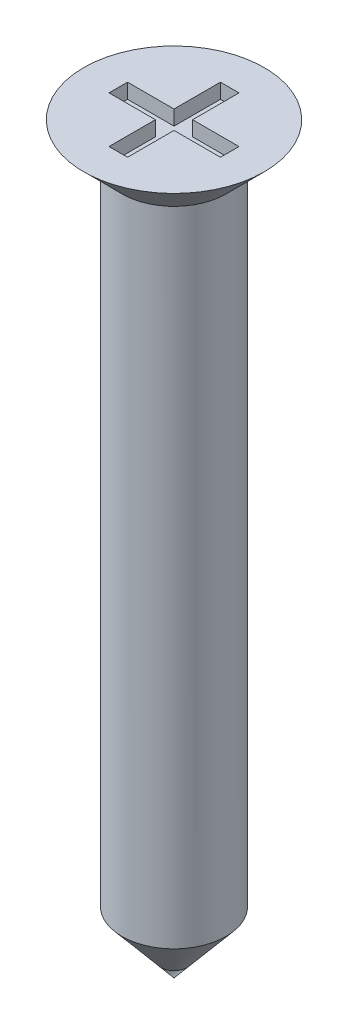
ISO-10303-21;
HEADER;
FILE_DESCRIPTION(('STEP AP214'),'2;1');
FILE_NAME('part.step','',(''),(''),'','','');
FILE_SCHEMA(('AUTOMOTIVE_DESIGN { 1 0 10303 214 1 1 1 1 }'));
ENDSEC;
DATA;
#1=APPLICATION_CONTEXT('core data for automotive mechanical design processes');
#2=APPLICATION_PROTOCOL_DEFINITION('international standard','automotive_design',2000,#1);
#3=PRODUCT_CONTEXT('',#1,'mechanical');
#4=PRODUCT('Part','Part','',(#3));
#5=PRODUCT_RELATED_PRODUCT_CATEGORY('part','',(#4));
#6=PRODUCT_DEFINITION_FORMATION('','',#4);
#7=PRODUCT_DEFINITION_CONTEXT('part definition',#1,'design');
#8=PRODUCT_DEFINITION('design','',#6,#7);
#9=PRODUCT_DEFINITION_SHAPE('','',#8);
#10=(LENGTH_UNIT() NAMED_UNIT(*) SI_UNIT(.MILLI.,.METRE.));
#11=(NAMED_UNIT(*) PLANE_ANGLE_UNIT() SI_UNIT($,.RADIAN.));
#12=(NAMED_UNIT(*) SI_UNIT($,.STERADIAN.) SOLID_ANGLE_UNIT());
#13=UNCERTAINTY_MEASURE_WITH_UNIT(LENGTH_MEASURE(1.E-05),#10,'distance_accuracy_value','');
#14=(GEOMETRIC_REPRESENTATION_CONTEXT(3) GLOBAL_UNCERTAINTY_ASSIGNED_CONTEXT((#13)) GLOBAL_UNIT_ASSIGNED_CONTEXT((#10,
#11,#12)) REPRESENTATION_CONTEXT('',''));
#15=CARTESIAN_POINT('',(0.,0.,0.));
#16=DIRECTION('',(0.,0.,1.));
#17=DIRECTION('',(1.,0.,0.));
#18=AXIS2_PLACEMENT_3D('',#15,#16,#17);
#19=CARTESIAN_POINT('',(0.,-9.16577248518406,0.));
#20=DIRECTION('',(0.,1.,0.));
#21=DIRECTION('',(-1.,0.,0.));
#22=AXIS2_PLACEMENT_3D('',#19,#20,#21);
#23=CONICAL_SURFACE('',#22,0.7,0.698131700797737);
#24=CARTESIAN_POINT('',(0.,-10.,0.));
#25=VERTEX_POINT('',#24);
#26=VERTEX_LOOP('',#25);
#27=FACE_BOUND('',#26,.T.);
#28=CARTESIAN_POINT('',(0.,-9.16577248518406,0.));
#29=DIRECTION('',(0.,-1.,0.));
#30=DIRECTION('',(1.,0.,0.));
#31=AXIS2_PLACEMENT_3D('',#28,#29,#30);
#32=CIRCLE('',#31,0.7);
#33=CARTESIAN_POINT('',(0.700000000000001,-9.16577248518406,0.));
#34=VERTEX_POINT('',#33);
#35=EDGE_CURVE('E11',#34,#34,#32,.T.);
#36=ORIENTED_EDGE('',*,*,#35,.T.);
#37=EDGE_LOOP('',(#36));
#38=FACE_BOUND('',#37,.T.);
#39=ADVANCED_FACE('F39',(#27,#38),#23,.T.);
#40=CARTESIAN_POINT('',(0.,-10.,0.));
#41=DIRECTION('',(0.,-1.,0.));
#42=DIRECTION('',(1.,0.,0.));
#43=AXIS2_PLACEMENT_3D('',#40,#41,#42);
#44=CYLINDRICAL_SURFACE('',#43,0.7);
#45=ORIENTED_EDGE('',*,*,#35,.F.);
#46=EDGE_LOOP('',(#45));
#47=FACE_BOUND('',#46,.T.);
#48=CARTESIAN_POINT('',(0.,-0.514999999999995,0.));
#49=DIRECTION('',(0.,-1.,0.));
#50=DIRECTION('',(1.,0.,0.));
#51=AXIS2_PLACEMENT_3D('',#48,#49,#50);
#52=CIRCLE('',#51,0.7);
#53=CARTESIAN_POINT('',(0.7,-0.514999999999995,0.));
#54=VERTEX_POINT('',#53);
#55=EDGE_CURVE('E47',#54,#54,#52,.T.);
#56=ORIENTED_EDGE('',*,*,#55,.T.);
#57=EDGE_LOOP('',(#56));
#58=FACE_BOUND('',#57,.T.);
#59=ADVANCED_FACE('F273',(#47,#58),#44,.T.);
#60=CARTESIAN_POINT('',(0.,0.,0.));
#61=DIRECTION('',(0.,1.,0.));
#62=DIRECTION('',(-1.,0.,0.));
#63=AXIS2_PLACEMENT_3D('',#60,#61,#62);
#64=CONICAL_SURFACE('',#63,1.215,0.785398163397454);
#65=ORIENTED_EDGE('',*,*,#55,.F.);
#66=EDGE_LOOP('',(#65));
#67=FACE_BOUND('',#66,.T.);
#68=CARTESIAN_POINT('',(0.,0.,0.));
#69=DIRECTION('',(0.,-1.,0.));
#70=DIRECTION('',(1.,0.,0.));
#71=AXIS2_PLACEMENT_3D('',#68,#69,#70);
#72=CIRCLE('',#71,1.215);
#73=CARTESIAN_POINT('',(1.215,0.,0.));
#74=VERTEX_POINT('',#73);
#75=EDGE_CURVE('E237',#74,#74,#72,.T.);
#76=ORIENTED_EDGE('',*,*,#75,.T.);
#77=EDGE_LOOP('',(#76));
#78=FACE_BOUND('',#77,.T.);
#79=ADVANCED_FACE('F275',(#67,#78),#64,.T.);
#80=CARTESIAN_POINT('',(0.,0.,0.));
#81=DIRECTION('',(0.,-1.,0.));
#82=DIRECTION('',(1.,0.,0.));
#83=AXIS2_PLACEMENT_3D('',#80,#81,#82);
#84=PLANE('',#83);
#85=DIRECTION('',(0.,0.,-1.));
#86=VECTOR('',#85,1.);
#87=CARTESIAN_POINT('',(0.125,0.,-0.125));
#88=LINE('',#87,#86);
#89=CARTESIAN_POINT('',(0.125,0.,-0.125));
#90=VERTEX_POINT('',#89);
#91=CARTESIAN_POINT('',(0.125,0.,-0.75));
#92=VERTEX_POINT('',#91);
#93=EDGE_CURVE('E196',#90,#92,#88,.T.);
#94=ORIENTED_EDGE('',*,*,#93,.F.);
#95=DIRECTION('',(-1.,0.,0.));
#96=VECTOR('',#95,1.);
#97=CARTESIAN_POINT('',(0.125,0.,-0.125));
#98=LINE('',#97,#96);
#99=CARTESIAN_POINT('',(0.75,0.,-0.125));
#100=VERTEX_POINT('',#99);
#101=EDGE_CURVE('E54',#100,#90,#98,.T.);
#102=ORIENTED_EDGE('',*,*,#101,.F.);
#103=DIRECTION('',(0.,0.,-1.));
#104=VECTOR('',#103,1.);
#105=CARTESIAN_POINT('',(0.75,0.,0.125));
#106=LINE('',#105,#104);
#107=CARTESIAN_POINT('',(0.75,0.,0.125));
#108=VERTEX_POINT('',#107);
#109=EDGE_CURVE('E152',#108,#100,#106,.T.);
#110=ORIENTED_EDGE('',*,*,#109,.F.);
#111=DIRECTION('',(1.,0.,0.));
#112=VECTOR('',#111,1.);
#113=CARTESIAN_POINT('',(0.125,0.,0.125));
#114=LINE('',#113,#112);
#115=CARTESIAN_POINT('',(0.125,0.,0.125));
#116=VERTEX_POINT('',#115);
#117=EDGE_CURVE('E156',#116,#108,#114,.T.);
#118=ORIENTED_EDGE('',*,*,#117,.F.);
#119=DIRECTION('',(0.,0.,-1.));
#120=VECTOR('',#119,1.);
#121=CARTESIAN_POINT('',(0.125,0.,0.75));
#122=LINE('',#121,#120);
#123=CARTESIAN_POINT('',(0.125,0.,0.75));
#124=VERTEX_POINT('',#123);
#125=EDGE_CURVE('E227',#124,#116,#122,.T.);
#126=ORIENTED_EDGE('',*,*,#125,.F.);
#127=DIRECTION('',(1.,0.,0.));
#128=VECTOR('',#127,1.);
#129=CARTESIAN_POINT('',(-0.125,0.,0.75));
#130=LINE('',#129,#128);
#131=CARTESIAN_POINT('',(-0.125,0.,0.75));
#132=VERTEX_POINT('',#131);
#133=EDGE_CURVE('E223',#132,#124,#130,.T.);
#134=ORIENTED_EDGE('',*,*,#133,.F.);
#135=DIRECTION('',(0.,0.,1.));
#136=VECTOR('',#135,1.);
#137=CARTESIAN_POINT('',(-0.125,0.,0.75));
#138=LINE('',#137,#136);
#139=CARTESIAN_POINT('',(-0.125,0.,0.125));
#140=VERTEX_POINT('',#139);
#141=EDGE_CURVE('E219',#140,#132,#138,.T.);
#142=ORIENTED_EDGE('',*,*,#141,.F.);
#143=DIRECTION('',(1.,0.,0.));
#144=VECTOR('',#143,1.);
#145=CARTESIAN_POINT('',(-0.75,0.,0.125));
#146=LINE('',#145,#144);
#147=CARTESIAN_POINT('',(-0.75,0.,0.125));
#148=VERTEX_POINT('',#147);
#149=EDGE_CURVE('E215',#148,#140,#146,.T.);
#150=ORIENTED_EDGE('',*,*,#149,.F.);
#151=DIRECTION('',(0.,0.,1.));
#152=VECTOR('',#151,1.);
#153=CARTESIAN_POINT('',(-0.75,0.,0.125));
#154=LINE('',#153,#152);
#155=CARTESIAN_POINT('',(-0.75,0.,-0.125));
#156=VERTEX_POINT('',#155);
#157=EDGE_CURVE('E211',#156,#148,#154,.T.);
#158=ORIENTED_EDGE('',*,*,#157,.F.);
#159=DIRECTION('',(-1.,0.,0.));
#160=VECTOR('',#159,1.);
#161=CARTESIAN_POINT('',(-0.75,0.,-0.125));
#162=LINE('',#161,#160);
#163=CARTESIAN_POINT('',(-0.125,0.,-0.125));
#164=VERTEX_POINT('',#163);
#165=EDGE_CURVE('E207',#164,#156,#162,.T.);
#166=ORIENTED_EDGE('',*,*,#165,.F.);
#167=DIRECTION('',(0.,0.,1.));
#168=VECTOR('',#167,1.);
#169=CARTESIAN_POINT('',(-0.125,0.,-0.125));
#170=LINE('',#169,#168);
#171=CARTESIAN_POINT('',(-0.125,0.,-0.75));
#172=VERTEX_POINT('',#171);
#173=EDGE_CURVE('E203',#172,#164,#170,.T.);
#174=ORIENTED_EDGE('',*,*,#173,.F.);
#175=DIRECTION('',(-1.,0.,0.));
#176=VECTOR('',#175,1.);
#177=CARTESIAN_POINT('',(-0.125,0.,-0.75));
#178=LINE('',#177,#176);
#179=EDGE_CURVE('E199',#92,#172,#178,.T.);
#180=ORIENTED_EDGE('',*,*,#179,.F.);
#181=EDGE_LOOP('',(#94,#102,#110,#118,#126,#134,#142,#150,#158,#166,#174,#180));
#182=FACE_BOUND('',#181,.T.);
#183=ORIENTED_EDGE('',*,*,#75,.F.);
#184=EDGE_LOOP('',(#183));
#185=FACE_BOUND('',#184,.T.);
#186=ADVANCED_FACE('F278',(#182,#185),#84,.F.);
#187=CARTESIAN_POINT('',(0.125,-0.2,-0.125));
#188=DIRECTION('',(0.,0.,-1.));
#189=DIRECTION('',(-1.,0.,0.));
#190=AXIS2_PLACEMENT_3D('',#187,#188,#189);
#191=PLANE('',#190);
#192=ORIENTED_EDGE('',*,*,#101,.T.);
#193=DIRECTION('',(0.,1.,0.));
#194=VECTOR('',#193,1.);
#195=CARTESIAN_POINT('',(0.125,-0.2,-0.125));
#196=LINE('',#195,#194);
#197=CARTESIAN_POINT('',(0.125,-0.2,-0.125));
#198=VERTEX_POINT('',#197);
#199=EDGE_CURVE('E126',#198,#90,#196,.T.);
#200=ORIENTED_EDGE('',*,*,#199,.F.);
#201=DIRECTION('',(-1.,0.,0.));
#202=VECTOR('',#201,1.);
#203=CARTESIAN_POINT('',(0.125,-0.2,-0.125));
#204=LINE('',#203,#202);
#205=CARTESIAN_POINT('',(0.75,-0.2,-0.125));
#206=VERTEX_POINT('',#205);
#207=EDGE_CURVE('E130',#206,#198,#204,.T.);
#208=ORIENTED_EDGE('',*,*,#207,.F.);
#209=DIRECTION('',(0.,1.,0.));
#210=VECTOR('',#209,1.);
#211=CARTESIAN_POINT('',(0.75,-0.2,-0.125));
#212=LINE('',#211,#210);
#213=EDGE_CURVE('E234',#206,#100,#212,.T.);
#214=ORIENTED_EDGE('',*,*,#213,.T.);
#215=EDGE_LOOP('',(#192,#200,#208,#214));
#216=FACE_BOUND('',#215,.T.);
#217=ADVANCED_FACE('F128',(#216),#191,.F.);
#218=CARTESIAN_POINT('',(0.75,-0.2,0.125));
#219=DIRECTION('',(1.,0.,0.));
#220=DIRECTION('',(0.,0.,-1.));
#221=AXIS2_PLACEMENT_3D('',#218,#219,#220);
#222=PLANE('',#221);
#223=ORIENTED_EDGE('',*,*,#109,.T.);
#224=ORIENTED_EDGE('',*,*,#213,.F.);
#225=DIRECTION('',(0.,0.,-1.));
#226=VECTOR('',#225,1.);
#227=CARTESIAN_POINT('',(0.75,-0.2,0.125));
#228=LINE('',#227,#226);
#229=CARTESIAN_POINT('',(0.75,-0.2,0.125));
#230=VERTEX_POINT('',#229);
#231=EDGE_CURVE('E137',#230,#206,#228,.T.);
#232=ORIENTED_EDGE('',*,*,#231,.F.);
#233=DIRECTION('',(0.,1.,0.));
#234=VECTOR('',#233,1.);
#235=CARTESIAN_POINT('',(0.75,-0.2,0.125));
#236=LINE('',#235,#234);
#237=EDGE_CURVE('E238',#230,#108,#236,.T.);
#238=ORIENTED_EDGE('',*,*,#237,.T.);
#239=EDGE_LOOP('',(#223,#224,#232,#238));
#240=FACE_BOUND('',#239,.T.);
#241=ADVANCED_FACE('F288',(#240),#222,.F.);
#242=CARTESIAN_POINT('',(0.125,-0.2,0.125));
#243=DIRECTION('',(0.,0.,1.));
#244=DIRECTION('',(1.,0.,0.));
#245=AXIS2_PLACEMENT_3D('',#242,#243,#244);
#246=PLANE('',#245);
#247=ORIENTED_EDGE('',*,*,#117,.T.);
#248=ORIENTED_EDGE('',*,*,#237,.F.);
#249=DIRECTION('',(1.,0.,0.));
#250=VECTOR('',#249,1.);
#251=CARTESIAN_POINT('',(0.125,-0.2,0.125));
#252=LINE('',#251,#250);
#253=CARTESIAN_POINT('',(0.125,-0.2,0.125));
#254=VERTEX_POINT('',#253);
#255=EDGE_CURVE('E189',#254,#230,#252,.T.);
#256=ORIENTED_EDGE('',*,*,#255,.F.);
#257=DIRECTION('',(0.,1.,0.));
#258=VECTOR('',#257,1.);
#259=CARTESIAN_POINT('',(0.125,-0.2,0.125));
#260=LINE('',#259,#258);
#261=EDGE_CURVE('E241',#254,#116,#260,.T.);
#262=ORIENTED_EDGE('',*,*,#261,.T.);
#263=EDGE_LOOP('',(#247,#248,#256,#262));
#264=FACE_BOUND('',#263,.T.);
#265=ADVANCED_FACE('F322',(#264),#246,.F.);
#266=CARTESIAN_POINT('',(0.125,-0.2,0.75));
#267=DIRECTION('',(1.,0.,0.));
#268=DIRECTION('',(0.,0.,-1.));
#269=AXIS2_PLACEMENT_3D('',#266,#267,#268);
#270=PLANE('',#269);
#271=ORIENTED_EDGE('',*,*,#125,.T.);
#272=ORIENTED_EDGE('',*,*,#261,.F.);
#273=DIRECTION('',(0.,0.,-1.));
#274=VECTOR('',#273,1.);
#275=CARTESIAN_POINT('',(0.125,-0.2,0.75));
#276=LINE('',#275,#274);
#277=CARTESIAN_POINT('',(0.125,-0.2,0.75));
#278=VERTEX_POINT('',#277);
#279=EDGE_CURVE('E185',#278,#254,#276,.T.);
#280=ORIENTED_EDGE('',*,*,#279,.F.);
#281=DIRECTION('',(0.,1.,0.));
#282=VECTOR('',#281,1.);
#283=CARTESIAN_POINT('',(0.125,-0.2,0.75));
#284=LINE('',#283,#282);
#285=EDGE_CURVE('E244',#278,#124,#284,.T.);
#286=ORIENTED_EDGE('',*,*,#285,.T.);
#287=EDGE_LOOP('',(#271,#272,#280,#286));
#288=FACE_BOUND('',#287,.T.);
#289=ADVANCED_FACE('F332',(#288),#270,.F.);
#290=CARTESIAN_POINT('',(-0.125,-0.2,0.75));
#291=DIRECTION('',(0.,0.,1.));
#292=DIRECTION('',(1.,0.,0.));
#293=AXIS2_PLACEMENT_3D('',#290,#291,#292);
#294=PLANE('',#293);
#295=ORIENTED_EDGE('',*,*,#133,.T.);
#296=ORIENTED_EDGE('',*,*,#285,.F.);
#297=DIRECTION('',(1.,0.,0.));
#298=VECTOR('',#297,1.);
#299=CARTESIAN_POINT('',(-0.125,-0.2,0.75));
#300=LINE('',#299,#298);
#301=CARTESIAN_POINT('',(-0.125,-0.2,0.75));
#302=VERTEX_POINT('',#301);
#303=EDGE_CURVE('E181',#302,#278,#300,.T.);
#304=ORIENTED_EDGE('',*,*,#303,.F.);
#305=DIRECTION('',(0.,1.,0.));
#306=VECTOR('',#305,1.);
#307=CARTESIAN_POINT('',(-0.125,-0.2,0.75));
#308=LINE('',#307,#306);
#309=EDGE_CURVE('E247',#302,#132,#308,.T.);
#310=ORIENTED_EDGE('',*,*,#309,.T.);
#311=EDGE_LOOP('',(#295,#296,#304,#310));
#312=FACE_BOUND('',#311,.T.);
#313=ADVANCED_FACE('F342',(#312),#294,.F.);
#314=CARTESIAN_POINT('',(-0.125,-0.2,0.75));
#315=DIRECTION('',(-1.,0.,0.));
#316=DIRECTION('',(0.,0.,1.));
#317=AXIS2_PLACEMENT_3D('',#314,#315,#316);
#318=PLANE('',#317);
#319=ORIENTED_EDGE('',*,*,#141,.T.);
#320=ORIENTED_EDGE('',*,*,#309,.F.);
#321=DIRECTION('',(0.,0.,1.));
#322=VECTOR('',#321,1.);
#323=CARTESIAN_POINT('',(-0.125,-0.2,0.75));
#324=LINE('',#323,#322);
#325=CARTESIAN_POINT('',(-0.125,-0.2,0.125));
#326=VERTEX_POINT('',#325);
#327=EDGE_CURVE('E177',#326,#302,#324,.T.);
#328=ORIENTED_EDGE('',*,*,#327,.F.);
#329=DIRECTION('',(0.,1.,0.));
#330=VECTOR('',#329,1.);
#331=CARTESIAN_POINT('',(-0.125,-0.2,0.125));
#332=LINE('',#331,#330);
#333=EDGE_CURVE('E250',#326,#140,#332,.T.);
#334=ORIENTED_EDGE('',*,*,#333,.T.);
#335=EDGE_LOOP('',(#319,#320,#328,#334));
#336=FACE_BOUND('',#335,.T.);
#337=ADVANCED_FACE('F352',(#336),#318,.F.);
#338=CARTESIAN_POINT('',(-0.75,-0.2,0.125));
#339=DIRECTION('',(0.,0.,1.));
#340=DIRECTION('',(1.,0.,0.));
#341=AXIS2_PLACEMENT_3D('',#338,#339,#340);
#342=PLANE('',#341);
#343=ORIENTED_EDGE('',*,*,#149,.T.);
#344=ORIENTED_EDGE('',*,*,#333,.F.);
#345=DIRECTION('',(1.,0.,0.));
#346=VECTOR('',#345,1.);
#347=CARTESIAN_POINT('',(-0.75,-0.2,0.125));
#348=LINE('',#347,#346);
#349=CARTESIAN_POINT('',(-0.75,-0.2,0.125));
#350=VERTEX_POINT('',#349);
#351=EDGE_CURVE('E173',#350,#326,#348,.T.);
#352=ORIENTED_EDGE('',*,*,#351,.F.);
#353=DIRECTION('',(0.,1.,0.));
#354=VECTOR('',#353,1.);
#355=CARTESIAN_POINT('',(-0.75,-0.2,0.125));
#356=LINE('',#355,#354);
#357=EDGE_CURVE('E253',#350,#148,#356,.T.);
#358=ORIENTED_EDGE('',*,*,#357,.T.);
#359=EDGE_LOOP('',(#343,#344,#352,#358));
#360=FACE_BOUND('',#359,.T.);
#361=ADVANCED_FACE('F362',(#360),#342,.F.);
#362=CARTESIAN_POINT('',(-0.75,-0.2,0.125));
#363=DIRECTION('',(-1.,0.,0.));
#364=DIRECTION('',(0.,0.,1.));
#365=AXIS2_PLACEMENT_3D('',#362,#363,#364);
#366=PLANE('',#365);
#367=ORIENTED_EDGE('',*,*,#157,.T.);
#368=ORIENTED_EDGE('',*,*,#357,.F.);
#369=DIRECTION('',(0.,0.,1.));
#370=VECTOR('',#369,1.);
#371=CARTESIAN_POINT('',(-0.75,-0.2,0.125));
#372=LINE('',#371,#370);
#373=CARTESIAN_POINT('',(-0.75,-0.2,-0.125));
#374=VERTEX_POINT('',#373);
#375=EDGE_CURVE('E169',#374,#350,#372,.T.);
#376=ORIENTED_EDGE('',*,*,#375,.F.);
#377=DIRECTION('',(0.,1.,0.));
#378=VECTOR('',#377,1.);
#379=CARTESIAN_POINT('',(-0.75,-0.2,-0.125));
#380=LINE('',#379,#378);
#381=EDGE_CURVE('E256',#374,#156,#380,.T.);
#382=ORIENTED_EDGE('',*,*,#381,.T.);
#383=EDGE_LOOP('',(#367,#368,#376,#382));
#384=FACE_BOUND('',#383,.T.);
#385=ADVANCED_FACE('F372',(#384),#366,.F.);
#386=CARTESIAN_POINT('',(-0.75,-0.2,-0.125));
#387=DIRECTION('',(0.,0.,-1.));
#388=DIRECTION('',(-1.,0.,0.));
#389=AXIS2_PLACEMENT_3D('',#386,#387,#388);
#390=PLANE('',#389);
#391=ORIENTED_EDGE('',*,*,#165,.T.);
#392=ORIENTED_EDGE('',*,*,#381,.F.);
#393=DIRECTION('',(-1.,0.,0.));
#394=VECTOR('',#393,1.);
#395=CARTESIAN_POINT('',(-0.75,-0.2,-0.125));
#396=LINE('',#395,#394);
#397=CARTESIAN_POINT('',(-0.125,-0.2,-0.125));
#398=VERTEX_POINT('',#397);
#399=EDGE_CURVE('E165',#398,#374,#396,.T.);
#400=ORIENTED_EDGE('',*,*,#399,.F.);
#401=DIRECTION('',(0.,1.,0.));
#402=VECTOR('',#401,1.);
#403=CARTESIAN_POINT('',(-0.125,-0.2,-0.125));
#404=LINE('',#403,#402);
#405=EDGE_CURVE('E259',#398,#164,#404,.T.);
#406=ORIENTED_EDGE('',*,*,#405,.T.);
#407=EDGE_LOOP('',(#391,#392,#400,#406));
#408=FACE_BOUND('',#407,.T.);
#409=ADVANCED_FACE('F382',(#408),#390,.F.);
#410=CARTESIAN_POINT('',(-0.125,-0.2,-0.125));
#411=DIRECTION('',(-1.,0.,0.));
#412=DIRECTION('',(0.,0.,1.));
#413=AXIS2_PLACEMENT_3D('',#410,#411,#412);
#414=PLANE('',#413);
#415=ORIENTED_EDGE('',*,*,#173,.T.);
#416=ORIENTED_EDGE('',*,*,#405,.F.);
#417=DIRECTION('',(0.,0.,1.));
#418=VECTOR('',#417,1.);
#419=CARTESIAN_POINT('',(-0.125,-0.2,-0.125));
#420=LINE('',#419,#418);
#421=CARTESIAN_POINT('',(-0.125,-0.2,-0.75));
#422=VERTEX_POINT('',#421);
#423=EDGE_CURVE('E161',#422,#398,#420,.T.);
#424=ORIENTED_EDGE('',*,*,#423,.F.);
#425=DIRECTION('',(0.,1.,0.));
#426=VECTOR('',#425,1.);
#427=CARTESIAN_POINT('',(-0.125,-0.2,-0.75));
#428=LINE('',#427,#426);
#429=EDGE_CURVE('E262',#422,#172,#428,.T.);
#430=ORIENTED_EDGE('',*,*,#429,.T.);
#431=EDGE_LOOP('',(#415,#416,#424,#430));
#432=FACE_BOUND('',#431,.T.);
#433=ADVANCED_FACE('F392',(#432),#414,.F.);
#434=CARTESIAN_POINT('',(-0.125,-0.2,-0.75));
#435=DIRECTION('',(0.,0.,-1.));
#436=DIRECTION('',(-1.,0.,0.));
#437=AXIS2_PLACEMENT_3D('',#434,#435,#436);
#438=PLANE('',#437);
#439=ORIENTED_EDGE('',*,*,#179,.T.);
#440=ORIENTED_EDGE('',*,*,#429,.F.);
#441=DIRECTION('',(-1.,0.,0.));
#442=VECTOR('',#441,1.);
#443=CARTESIAN_POINT('',(-0.125,-0.2,-0.75));
#444=LINE('',#443,#442);
#445=CARTESIAN_POINT('',(0.125,-0.2,-0.75));
#446=VERTEX_POINT('',#445);
#447=EDGE_CURVE('E146',#446,#422,#444,.T.);
#448=ORIENTED_EDGE('',*,*,#447,.F.);
#449=DIRECTION('',(0.,1.,0.));
#450=VECTOR('',#449,1.);
#451=CARTESIAN_POINT('',(0.125,-0.2,-0.75));
#452=LINE('',#451,#450);
#453=EDGE_CURVE('E136',#446,#92,#452,.T.);
#454=ORIENTED_EDGE('',*,*,#453,.T.);
#455=EDGE_LOOP('',(#439,#440,#448,#454));
#456=FACE_BOUND('',#455,.T.);
#457=ADVANCED_FACE('F402',(#456),#438,.F.);
#458=CARTESIAN_POINT('',(0.125,-0.2,-0.125));
#459=DIRECTION('',(1.,0.,0.));
#460=DIRECTION('',(0.,0.,-1.));
#461=AXIS2_PLACEMENT_3D('',#458,#459,#460);
#462=PLANE('',#461);
#463=ORIENTED_EDGE('',*,*,#93,.T.);
#464=ORIENTED_EDGE('',*,*,#453,.F.);
#465=DIRECTION('',(0.,0.,-1.));
#466=VECTOR('',#465,1.);
#467=CARTESIAN_POINT('',(0.125,-0.2,-0.125));
#468=LINE('',#467,#466);
#469=EDGE_CURVE('E140',#198,#446,#468,.T.);
#470=ORIENTED_EDGE('',*,*,#469,.F.);
#471=ORIENTED_EDGE('',*,*,#199,.T.);
#472=EDGE_LOOP('',(#463,#464,#470,#471));
#473=FACE_BOUND('',#472,.T.);
#474=ADVANCED_FACE('F141',(#473),#462,.F.);
#475=CARTESIAN_POINT('',(0.,-0.2,0.));
#476=DIRECTION('',(0.,1.,0.));
#477=DIRECTION('',(0.,0.,1.));
#478=AXIS2_PLACEMENT_3D('',#475,#476,#477);
#479=PLANE('',#478);
#480=ORIENTED_EDGE('',*,*,#207,.T.);
#481=ORIENTED_EDGE('',*,*,#469,.T.);
#482=ORIENTED_EDGE('',*,*,#447,.T.);
#483=ORIENTED_EDGE('',*,*,#423,.T.);
#484=ORIENTED_EDGE('',*,*,#399,.T.);
#485=ORIENTED_EDGE('',*,*,#375,.T.);
#486=ORIENTED_EDGE('',*,*,#351,.T.);
#487=ORIENTED_EDGE('',*,*,#327,.T.);
#488=ORIENTED_EDGE('',*,*,#303,.T.);
#489=ORIENTED_EDGE('',*,*,#279,.T.);
#490=ORIENTED_EDGE('',*,*,#255,.T.);
#491=ORIENTED_EDGE('',*,*,#231,.T.);
#492=EDGE_LOOP('',(#480,#481,#482,#483,#484,#485,#486,#487,#488,#489,#490,#491));
#493=FACE_BOUND('',#492,.T.);
#494=ADVANCED_FACE('F148',(#493),#479,.T.);
#495=CLOSED_SHELL('',(#39,#59,#79,#186,#217,#241,#265,#289,#313,#337,#361,#385,#409,#433,#457,
#474,#494));
#496=MANIFOLD_SOLID_BREP('B2',#495);
#497=ADVANCED_BREP_SHAPE_REPRESENTATION('',(#18,#496),#14);
#498=SHAPE_DEFINITION_REPRESENTATION(#9,#497);
ENDSEC;
END-ISO-10303-21;
